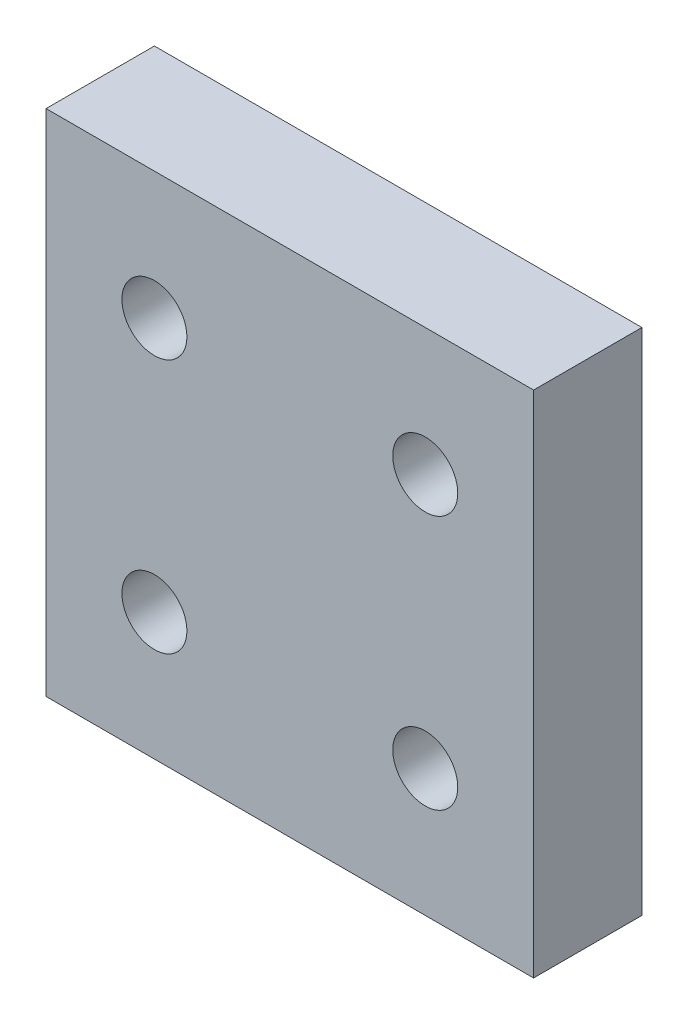
ISO-10303-21;
HEADER;
FILE_DESCRIPTION(('STEP AP214'),'2;1');
FILE_NAME('part.step','',(''),(''),'','','');
FILE_SCHEMA(('AUTOMOTIVE_DESIGN { 1 0 10303 214 1 1 1 1 }'));
ENDSEC;
DATA;
#1=APPLICATION_CONTEXT('core data for automotive mechanical design processes');
#2=APPLICATION_PROTOCOL_DEFINITION('international standard','automotive_design',2000,#1);
#3=PRODUCT_CONTEXT('',#1,'mechanical');
#4=PRODUCT('Part','Part','',(#3));
#5=PRODUCT_RELATED_PRODUCT_CATEGORY('part','',(#4));
#6=PRODUCT_DEFINITION_FORMATION('','',#4);
#7=PRODUCT_DEFINITION_CONTEXT('part definition',#1,'design');
#8=PRODUCT_DEFINITION('design','',#6,#7);
#9=PRODUCT_DEFINITION_SHAPE('','',#8);
#10=(LENGTH_UNIT() NAMED_UNIT(*) SI_UNIT(.MILLI.,.METRE.));
#11=(NAMED_UNIT(*) PLANE_ANGLE_UNIT() SI_UNIT($,.RADIAN.));
#12=(NAMED_UNIT(*) SI_UNIT($,.STERADIAN.) SOLID_ANGLE_UNIT());
#13=UNCERTAINTY_MEASURE_WITH_UNIT(LENGTH_MEASURE(1.E-05),#10,'distance_accuracy_value','');
#14=(GEOMETRIC_REPRESENTATION_CONTEXT(3) GLOBAL_UNCERTAINTY_ASSIGNED_CONTEXT((#13)) GLOBAL_UNIT_ASSIGNED_CONTEXT((#10,
#11,#12)) REPRESENTATION_CONTEXT('',''));
#15=CARTESIAN_POINT('',(0.,0.,0.));
#16=DIRECTION('',(0.,0.,1.));
#17=DIRECTION('',(1.,0.,0.));
#18=AXIS2_PLACEMENT_3D('',#15,#16,#17);
#19=CARTESIAN_POINT('',(0.,0.,4.));
#20=DIRECTION('',(0.,0.,1.));
#21=DIRECTION('',(1.,0.,0.));
#22=AXIS2_PLACEMENT_3D('',#19,#20,#21);
#23=PLANE('',#22);
#24=CARTESIAN_POINT('',(5.,-4.7,4.));
#25=DIRECTION('',(0.,0.,1.));
#26=DIRECTION('',(1.,0.,0.));
#27=AXIS2_PLACEMENT_3D('',#24,#25,#26);
#28=CIRCLE('',#27,1.2);
#29=CARTESIAN_POINT('',(6.2,-4.7,4.));
#30=VERTEX_POINT('',#29);
#31=EDGE_CURVE('E120',#30,#30,#28,.T.);
#32=ORIENTED_EDGE('',*,*,#31,.F.);
#33=EDGE_LOOP('',(#32));
#34=FACE_BOUND('',#33,.T.);
#35=CARTESIAN_POINT('',(-5.,4.7,4.));
#36=DIRECTION('',(0.,0.,1.));
#37=DIRECTION('',(1.,0.,0.));
#38=AXIS2_PLACEMENT_3D('',#35,#36,#37);
#39=CIRCLE('',#38,1.2);
#40=CARTESIAN_POINT('',(-3.8,4.7,4.));
#41=VERTEX_POINT('',#40);
#42=EDGE_CURVE('E99',#41,#41,#39,.T.);
#43=ORIENTED_EDGE('',*,*,#42,.F.);
#44=EDGE_LOOP('',(#43));
#45=FACE_BOUND('',#44,.T.);
#46=DIRECTION('',(0.,1.,0.));
#47=VECTOR('',#46,1.);
#48=CARTESIAN_POINT('',(9.,9.4,4.));
#49=LINE('',#48,#47);
#50=CARTESIAN_POINT('',(9.,-9.4,4.));
#51=VERTEX_POINT('',#50);
#52=CARTESIAN_POINT('',(9.,9.4,4.));
#53=VERTEX_POINT('',#52);
#54=EDGE_CURVE('E84',#51,#53,#49,.T.);
#55=ORIENTED_EDGE('',*,*,#54,.T.);
#56=DIRECTION('',(-1.,0.,0.));
#57=VECTOR('',#56,1.);
#58=CARTESIAN_POINT('',(-9.,9.4,4.));
#59=LINE('',#58,#57);
#60=CARTESIAN_POINT('',(-9.,9.4,4.));
#61=VERTEX_POINT('',#60);
#62=EDGE_CURVE('E79',#53,#61,#59,.T.);
#63=ORIENTED_EDGE('',*,*,#62,.T.);
#64=DIRECTION('',(0.,-1.,0.));
#65=VECTOR('',#64,1.);
#66=CARTESIAN_POINT('',(-9.,9.4,4.));
#67=LINE('',#66,#65);
#68=CARTESIAN_POINT('',(-9.,-9.4,4.));
#69=VERTEX_POINT('',#68);
#70=EDGE_CURVE('E82',#61,#69,#67,.T.);
#71=ORIENTED_EDGE('',*,*,#70,.T.);
#72=DIRECTION('',(1.,0.,0.));
#73=VECTOR('',#72,1.);
#74=CARTESIAN_POINT('',(-9.,-9.4,4.));
#75=LINE('',#74,#73);
#76=EDGE_CURVE('E49',#69,#51,#75,.T.);
#77=ORIENTED_EDGE('',*,*,#76,.T.);
#78=EDGE_LOOP('',(#55,#63,#71,#77));
#79=FACE_BOUND('',#78,.T.);
#80=CARTESIAN_POINT('',(5.,4.7,4.));
#81=DIRECTION('',(0.,0.,1.));
#82=DIRECTION('',(1.,0.,0.));
#83=AXIS2_PLACEMENT_3D('',#80,#81,#82);
#84=CIRCLE('',#83,1.2);
#85=CARTESIAN_POINT('',(6.2,4.7,4.));
#86=VERTEX_POINT('',#85);
#87=EDGE_CURVE('E114',#86,#86,#84,.T.);
#88=ORIENTED_EDGE('',*,*,#87,.F.);
#89=EDGE_LOOP('',(#88));
#90=FACE_BOUND('',#89,.T.);
#91=CARTESIAN_POINT('',(-4.99999999999997,-4.7,4.));
#92=DIRECTION('',(0.,0.,1.));
#93=DIRECTION('',(1.,0.,0.));
#94=AXIS2_PLACEMENT_3D('',#91,#92,#93);
#95=CIRCLE('',#94,1.2);
#96=CARTESIAN_POINT('',(-3.79999999999997,-4.7,4.));
#97=VERTEX_POINT('',#96);
#98=EDGE_CURVE('E126',#97,#97,#95,.T.);
#99=ORIENTED_EDGE('',*,*,#98,.F.);
#100=EDGE_LOOP('',(#99));
#101=FACE_BOUND('',#100,.T.);
#102=ADVANCED_FACE('F32',(#34,#45,#79,#90,#101),#23,.T.);
#103=CARTESIAN_POINT('',(0.,0.,0.));
#104=DIRECTION('',(0.,0.,1.));
#105=DIRECTION('',(1.,0.,0.));
#106=AXIS2_PLACEMENT_3D('',#103,#104,#105);
#107=PLANE('',#106);
#108=DIRECTION('',(0.,1.,0.));
#109=VECTOR('',#108,1.);
#110=CARTESIAN_POINT('',(9.,9.4,0.));
#111=LINE('',#110,#109);
#112=CARTESIAN_POINT('',(9.,-9.4,0.));
#113=VERTEX_POINT('',#112);
#114=CARTESIAN_POINT('',(9.,9.4,0.));
#115=VERTEX_POINT('',#114);
#116=EDGE_CURVE('E96',#113,#115,#111,.T.);
#117=ORIENTED_EDGE('',*,*,#116,.F.);
#118=DIRECTION('',(1.,0.,0.));
#119=VECTOR('',#118,1.);
#120=CARTESIAN_POINT('',(-9.,-9.4,0.));
#121=LINE('',#120,#119);
#122=CARTESIAN_POINT('',(-9.,-9.4,0.));
#123=VERTEX_POINT('',#122);
#124=EDGE_CURVE('E72',#123,#113,#121,.T.);
#125=ORIENTED_EDGE('',*,*,#124,.F.);
#126=DIRECTION('',(0.,-1.,0.));
#127=VECTOR('',#126,1.);
#128=CARTESIAN_POINT('',(-9.,9.4,0.));
#129=LINE('',#128,#127);
#130=CARTESIAN_POINT('',(-9.,9.4,0.));
#131=VERTEX_POINT('',#130);
#132=EDGE_CURVE('E66',#131,#123,#129,.T.);
#133=ORIENTED_EDGE('',*,*,#132,.F.);
#134=DIRECTION('',(-1.,0.,0.));
#135=VECTOR('',#134,1.);
#136=CARTESIAN_POINT('',(-9.,9.4,0.));
#137=LINE('',#136,#135);
#138=EDGE_CURVE('E88',#115,#131,#137,.T.);
#139=ORIENTED_EDGE('',*,*,#138,.F.);
#140=EDGE_LOOP('',(#117,#125,#133,#139));
#141=FACE_BOUND('',#140,.T.);
#142=CARTESIAN_POINT('',(-5.,4.7,0.));
#143=DIRECTION('',(0.,0.,1.));
#144=DIRECTION('',(1.,0.,0.));
#145=AXIS2_PLACEMENT_3D('',#142,#143,#144);
#146=CIRCLE('',#145,1.2);
#147=CARTESIAN_POINT('',(-3.8,4.7,0.));
#148=VERTEX_POINT('',#147);
#149=EDGE_CURVE('E111',#148,#148,#146,.T.);
#150=ORIENTED_EDGE('',*,*,#149,.T.);
#151=EDGE_LOOP('',(#150));
#152=FACE_BOUND('',#151,.T.);
#153=CARTESIAN_POINT('',(5.,4.7,0.));
#154=DIRECTION('',(0.,0.,1.));
#155=DIRECTION('',(1.,0.,0.));
#156=AXIS2_PLACEMENT_3D('',#153,#154,#155);
#157=CIRCLE('',#156,1.2);
#158=CARTESIAN_POINT('',(6.2,4.7,0.));
#159=VERTEX_POINT('',#158);
#160=EDGE_CURVE('E117',#159,#159,#157,.T.);
#161=ORIENTED_EDGE('',*,*,#160,.T.);
#162=EDGE_LOOP('',(#161));
#163=FACE_BOUND('',#162,.T.);
#164=CARTESIAN_POINT('',(5.,-4.7,0.));
#165=DIRECTION('',(0.,0.,1.));
#166=DIRECTION('',(1.,0.,0.));
#167=AXIS2_PLACEMENT_3D('',#164,#165,#166);
#168=CIRCLE('',#167,1.2);
#169=CARTESIAN_POINT('',(6.2,-4.7,0.));
#170=VERTEX_POINT('',#169);
#171=EDGE_CURVE('E123',#170,#170,#168,.T.);
#172=ORIENTED_EDGE('',*,*,#171,.T.);
#173=EDGE_LOOP('',(#172));
#174=FACE_BOUND('',#173,.T.);
#175=CARTESIAN_POINT('',(-4.99999999999997,-4.7,0.));
#176=DIRECTION('',(0.,0.,1.));
#177=DIRECTION('',(1.,0.,0.));
#178=AXIS2_PLACEMENT_3D('',#175,#176,#177);
#179=CIRCLE('',#178,1.2);
#180=CARTESIAN_POINT('',(-3.79999999999997,-4.7,0.));
#181=VERTEX_POINT('',#180);
#182=EDGE_CURVE('E129',#181,#181,#179,.T.);
#183=ORIENTED_EDGE('',*,*,#182,.T.);
#184=EDGE_LOOP('',(#183));
#185=FACE_BOUND('',#184,.T.);
#186=ADVANCED_FACE('F107',(#141,#152,#163,#174,#185),#107,.F.);
#187=CARTESIAN_POINT('',(9.,9.4,4.));
#188=DIRECTION('',(-1.,0.,0.));
#189=DIRECTION('',(0.,-1.,0.));
#190=AXIS2_PLACEMENT_3D('',#187,#188,#189);
#191=PLANE('',#190);
#192=ORIENTED_EDGE('',*,*,#116,.T.);
#193=DIRECTION('',(0.,0.,-1.));
#194=VECTOR('',#193,1.);
#195=CARTESIAN_POINT('',(9.,9.4,4.));
#196=LINE('',#195,#194);
#197=EDGE_CURVE('E11',#53,#115,#196,.T.);
#198=ORIENTED_EDGE('',*,*,#197,.F.);
#199=ORIENTED_EDGE('',*,*,#54,.F.);
#200=DIRECTION('',(0.,0.,-1.));
#201=VECTOR('',#200,1.);
#202=CARTESIAN_POINT('',(9.,-9.4,4.));
#203=LINE('',#202,#201);
#204=EDGE_CURVE('E92',#51,#113,#203,.T.);
#205=ORIENTED_EDGE('',*,*,#204,.T.);
#206=EDGE_LOOP('',(#192,#198,#199,#205));
#207=FACE_BOUND('',#206,.T.);
#208=ADVANCED_FACE('F34',(#207),#191,.F.);
#209=CARTESIAN_POINT('',(-9.,9.4,4.));
#210=DIRECTION('',(0.,-1.,0.));
#211=DIRECTION('',(0.,0.,-1.));
#212=AXIS2_PLACEMENT_3D('',#209,#210,#211);
#213=PLANE('',#212);
#214=ORIENTED_EDGE('',*,*,#138,.T.);
#215=DIRECTION('',(0.,0.,-1.));
#216=VECTOR('',#215,1.);
#217=CARTESIAN_POINT('',(-9.,9.4,4.));
#218=LINE('',#217,#216);
#219=EDGE_CURVE('E41',#61,#131,#218,.T.);
#220=ORIENTED_EDGE('',*,*,#219,.F.);
#221=ORIENTED_EDGE('',*,*,#62,.F.);
#222=ORIENTED_EDGE('',*,*,#197,.T.);
#223=EDGE_LOOP('',(#214,#220,#221,#222));
#224=FACE_BOUND('',#223,.T.);
#225=ADVANCED_FACE('F87',(#224),#213,.F.);
#226=CARTESIAN_POINT('',(-9.,9.4,4.));
#227=DIRECTION('',(1.,0.,0.));
#228=DIRECTION('',(0.,1.,0.));
#229=AXIS2_PLACEMENT_3D('',#226,#227,#228);
#230=PLANE('',#229);
#231=ORIENTED_EDGE('',*,*,#132,.T.);
#232=DIRECTION('',(0.,0.,-1.));
#233=VECTOR('',#232,1.);
#234=CARTESIAN_POINT('',(-9.,-9.4,4.));
#235=LINE('',#234,#233);
#236=EDGE_CURVE('E89',#69,#123,#235,.T.);
#237=ORIENTED_EDGE('',*,*,#236,.F.);
#238=ORIENTED_EDGE('',*,*,#70,.F.);
#239=ORIENTED_EDGE('',*,*,#219,.T.);
#240=EDGE_LOOP('',(#231,#237,#238,#239));
#241=FACE_BOUND('',#240,.T.);
#242=ADVANCED_FACE('F90',(#241),#230,.F.);
#243=CARTESIAN_POINT('',(-9.,-9.4,4.));
#244=DIRECTION('',(0.,1.,0.));
#245=DIRECTION('',(0.,0.,1.));
#246=AXIS2_PLACEMENT_3D('',#243,#244,#245);
#247=PLANE('',#246);
#248=ORIENTED_EDGE('',*,*,#124,.T.);
#249=ORIENTED_EDGE('',*,*,#204,.F.);
#250=ORIENTED_EDGE('',*,*,#76,.F.);
#251=ORIENTED_EDGE('',*,*,#236,.T.);
#252=EDGE_LOOP('',(#248,#249,#250,#251));
#253=FACE_BOUND('',#252,.T.);
#254=ADVANCED_FACE('F104',(#253),#247,.F.);
#255=CARTESIAN_POINT('',(-5.,4.7,4.));
#256=DIRECTION('',(0.,0.,-1.));
#257=DIRECTION('',(-1.,0.,0.));
#258=AXIS2_PLACEMENT_3D('',#255,#256,#257);
#259=CYLINDRICAL_SURFACE('',#258,1.2);
#260=ORIENTED_EDGE('',*,*,#42,.T.);
#261=EDGE_LOOP('',(#260));
#262=FACE_BOUND('',#261,.T.);
#263=ORIENTED_EDGE('',*,*,#149,.F.);
#264=EDGE_LOOP('',(#263));
#265=FACE_BOUND('',#264,.T.);
#266=ADVANCED_FACE('F148',(#262,#265),#259,.F.);
#267=CARTESIAN_POINT('',(5.,4.7,4.));
#268=DIRECTION('',(0.,0.,-1.));
#269=DIRECTION('',(-1.,0.,0.));
#270=AXIS2_PLACEMENT_3D('',#267,#268,#269);
#271=CYLINDRICAL_SURFACE('',#270,1.2);
#272=ORIENTED_EDGE('',*,*,#87,.T.);
#273=EDGE_LOOP('',(#272));
#274=FACE_BOUND('',#273,.T.);
#275=ORIENTED_EDGE('',*,*,#160,.F.);
#276=EDGE_LOOP('',(#275));
#277=FACE_BOUND('',#276,.T.);
#278=ADVANCED_FACE('F194',(#274,#277),#271,.F.);
#279=CARTESIAN_POINT('',(5.,-4.7,4.));
#280=DIRECTION('',(0.,0.,-1.));
#281=DIRECTION('',(-1.,0.,0.));
#282=AXIS2_PLACEMENT_3D('',#279,#280,#281);
#283=CYLINDRICAL_SURFACE('',#282,1.2);
#284=ORIENTED_EDGE('',*,*,#31,.T.);
#285=EDGE_LOOP('',(#284));
#286=FACE_BOUND('',#285,.T.);
#287=ORIENTED_EDGE('',*,*,#171,.F.);
#288=EDGE_LOOP('',(#287));
#289=FACE_BOUND('',#288,.T.);
#290=ADVANCED_FACE('F202',(#286,#289),#283,.F.);
#291=CARTESIAN_POINT('',(-4.99999999999997,-4.7,4.));
#292=DIRECTION('',(0.,0.,-1.));
#293=DIRECTION('',(-1.,0.,0.));
#294=AXIS2_PLACEMENT_3D('',#291,#292,#293);
#295=CYLINDRICAL_SURFACE('',#294,1.2);
#296=ORIENTED_EDGE('',*,*,#98,.T.);
#297=EDGE_LOOP('',(#296));
#298=FACE_BOUND('',#297,.T.);
#299=ORIENTED_EDGE('',*,*,#182,.F.);
#300=EDGE_LOOP('',(#299));
#301=FACE_BOUND('',#300,.T.);
#302=ADVANCED_FACE('F135',(#298,#301),#295,.F.);
#303=CLOSED_SHELL('',(#102,#186,#208,#225,#242,#254,#266,#278,#290,#302));
#304=MANIFOLD_SOLID_BREP('B2',#303);
#305=ADVANCED_BREP_SHAPE_REPRESENTATION('',(#18,#304),#14);
#306=SHAPE_DEFINITION_REPRESENTATION(#9,#305);
ENDSEC;
END-ISO-10303-21;
